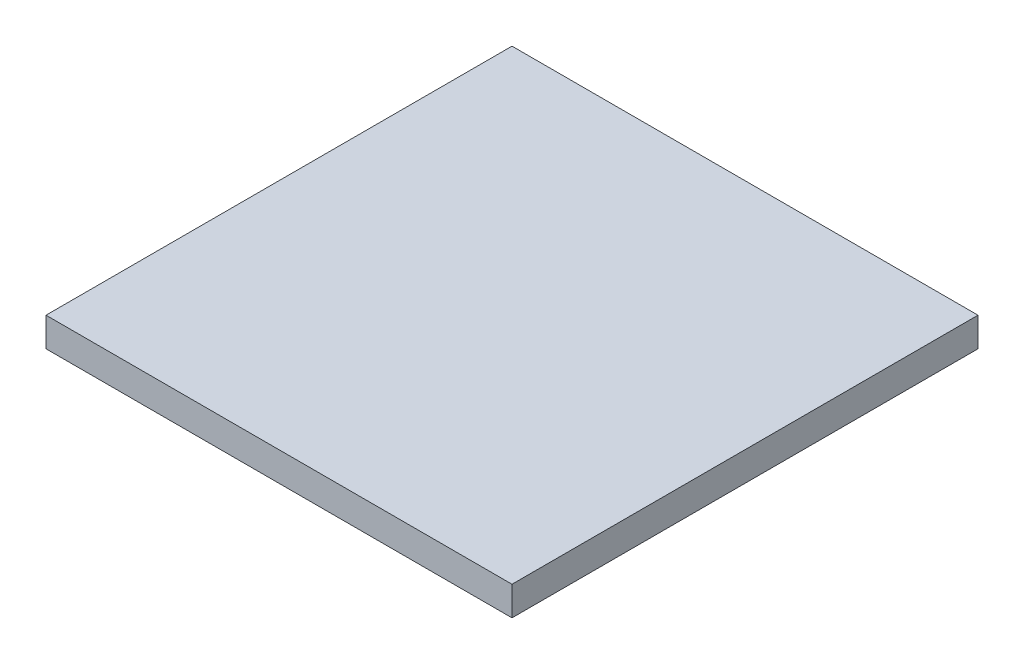
ISO-10303-21;
HEADER;
FILE_DESCRIPTION(('STEP AP214'),'2;1');
FILE_NAME('part.step','',(''),(''),'','','');
FILE_SCHEMA(('AUTOMOTIVE_DESIGN { 1 0 10303 214 1 1 1 1 }'));
ENDSEC;
DATA;
#1=APPLICATION_CONTEXT('core data for automotive mechanical design processes');
#2=APPLICATION_PROTOCOL_DEFINITION('international standard','automotive_design',2000,#1);
#3=PRODUCT_CONTEXT('',#1,'mechanical');
#4=PRODUCT('Part','Part','',(#3));
#5=PRODUCT_RELATED_PRODUCT_CATEGORY('part','',(#4));
#6=PRODUCT_DEFINITION_FORMATION('','',#4);
#7=PRODUCT_DEFINITION_CONTEXT('part definition',#1,'design');
#8=PRODUCT_DEFINITION('design','',#6,#7);
#9=PRODUCT_DEFINITION_SHAPE('','',#8);
#10=(LENGTH_UNIT() NAMED_UNIT(*) SI_UNIT(.MILLI.,.METRE.));
#11=(NAMED_UNIT(*) PLANE_ANGLE_UNIT() SI_UNIT($,.RADIAN.));
#12=(NAMED_UNIT(*) SI_UNIT($,.STERADIAN.) SOLID_ANGLE_UNIT());
#13=UNCERTAINTY_MEASURE_WITH_UNIT(LENGTH_MEASURE(1.E-05),#10,'distance_accuracy_value','');
#14=(GEOMETRIC_REPRESENTATION_CONTEXT(3) GLOBAL_UNCERTAINTY_ASSIGNED_CONTEXT((#13)) GLOBAL_UNIT_ASSIGNED_CONTEXT((#10,
#11,#12)) REPRESENTATION_CONTEXT('',''));
#15=CARTESIAN_POINT('',(0.,0.,0.));
#16=DIRECTION('',(0.,0.,1.));
#17=DIRECTION('',(1.,0.,0.));
#18=AXIS2_PLACEMENT_3D('',#15,#16,#17);
#19=CARTESIAN_POINT('',(0.,1.5875,0.));
#20=DIRECTION('',(1.,0.,0.));
#21=DIRECTION('',(0.,0.,-1.));
#22=AXIS2_PLACEMENT_3D('',#19,#20,#21);
#23=PLANE('',#22);
#24=DIRECTION('',(0.,0.,1.));
#25=VECTOR('',#24,1.);
#26=CARTESIAN_POINT('',(0.,0.,0.));
#27=LINE('',#26,#25);
#28=CARTESIAN_POINT('',(0.,0.,-25.4));
#29=VERTEX_POINT('',#28);
#30=CARTESIAN_POINT('',(0.,0.,0.));
#31=VERTEX_POINT('',#30);
#32=EDGE_CURVE('E95',#29,#31,#27,.T.);
#33=ORIENTED_EDGE('',*,*,#32,.T.);
#34=DIRECTION('',(0.,-1.,0.));
#35=VECTOR('',#34,1.);
#36=CARTESIAN_POINT('',(0.,1.5875,0.));
#37=LINE('',#36,#35);
#38=CARTESIAN_POINT('',(0.,1.5875,0.));
#39=VERTEX_POINT('',#38);
#40=EDGE_CURVE('E11',#39,#31,#37,.T.);
#41=ORIENTED_EDGE('',*,*,#40,.F.);
#42=DIRECTION('',(0.,0.,1.));
#43=VECTOR('',#42,1.);
#44=CARTESIAN_POINT('',(0.,1.5875,0.));
#45=LINE('',#44,#43);
#46=CARTESIAN_POINT('',(0.,1.5875,-25.4));
#47=VERTEX_POINT('',#46);
#48=EDGE_CURVE('E83',#47,#39,#45,.T.);
#49=ORIENTED_EDGE('',*,*,#48,.F.);
#50=DIRECTION('',(0.,-1.,0.));
#51=VECTOR('',#50,1.);
#52=CARTESIAN_POINT('',(0.,1.5875,-25.4));
#53=LINE('',#52,#51);
#54=EDGE_CURVE('E91',#47,#29,#53,.T.);
#55=ORIENTED_EDGE('',*,*,#54,.T.);
#56=EDGE_LOOP('',(#33,#41,#49,#55));
#57=FACE_BOUND('',#56,.T.);
#58=ADVANCED_FACE('F32',(#57),#23,.F.);
#59=CARTESIAN_POINT('',(0.,1.5875,0.));
#60=DIRECTION('',(0.,0.,-1.));
#61=DIRECTION('',(-1.,0.,0.));
#62=AXIS2_PLACEMENT_3D('',#59,#60,#61);
#63=PLANE('',#62);
#64=DIRECTION('',(1.,0.,0.));
#65=VECTOR('',#64,1.);
#66=CARTESIAN_POINT('',(0.,0.,0.));
#67=LINE('',#66,#65);
#68=CARTESIAN_POINT('',(25.4,0.,0.));
#69=VERTEX_POINT('',#68);
#70=EDGE_CURVE('E87',#31,#69,#67,.T.);
#71=ORIENTED_EDGE('',*,*,#70,.T.);
#72=DIRECTION('',(0.,-1.,0.));
#73=VECTOR('',#72,1.);
#74=CARTESIAN_POINT('',(25.4,1.5875,0.));
#75=LINE('',#74,#73);
#76=CARTESIAN_POINT('',(25.4,1.5875,0.));
#77=VERTEX_POINT('',#76);
#78=EDGE_CURVE('E40',#77,#69,#75,.T.);
#79=ORIENTED_EDGE('',*,*,#78,.F.);
#80=DIRECTION('',(1.,0.,0.));
#81=VECTOR('',#80,1.);
#82=CARTESIAN_POINT('',(0.,1.5875,0.));
#83=LINE('',#82,#81);
#84=EDGE_CURVE('E78',#39,#77,#83,.T.);
#85=ORIENTED_EDGE('',*,*,#84,.F.);
#86=ORIENTED_EDGE('',*,*,#40,.T.);
#87=EDGE_LOOP('',(#71,#79,#85,#86));
#88=FACE_BOUND('',#87,.T.);
#89=ADVANCED_FACE('F86',(#88),#63,.F.);
#90=CARTESIAN_POINT('',(25.4,1.5875,0.));
#91=DIRECTION('',(-1.,0.,0.));
#92=DIRECTION('',(0.,0.,1.));
#93=AXIS2_PLACEMENT_3D('',#90,#91,#92);
#94=PLANE('',#93);
#95=DIRECTION('',(0.,0.,-1.));
#96=VECTOR('',#95,1.);
#97=CARTESIAN_POINT('',(25.4,0.,0.));
#98=LINE('',#97,#96);
#99=CARTESIAN_POINT('',(25.4,0.,-25.4));
#100=VERTEX_POINT('',#99);
#101=EDGE_CURVE('E65',#69,#100,#98,.T.);
#102=ORIENTED_EDGE('',*,*,#101,.T.);
#103=DIRECTION('',(0.,-1.,0.));
#104=VECTOR('',#103,1.);
#105=CARTESIAN_POINT('',(25.4,1.5875,-25.4));
#106=LINE('',#105,#104);
#107=CARTESIAN_POINT('',(25.4,1.5875,-25.4));
#108=VERTEX_POINT('',#107);
#109=EDGE_CURVE('E88',#108,#100,#106,.T.);
#110=ORIENTED_EDGE('',*,*,#109,.F.);
#111=DIRECTION('',(0.,0.,-1.));
#112=VECTOR('',#111,1.);
#113=CARTESIAN_POINT('',(25.4,1.5875,0.));
#114=LINE('',#113,#112);
#115=EDGE_CURVE('E81',#77,#108,#114,.T.);
#116=ORIENTED_EDGE('',*,*,#115,.F.);
#117=ORIENTED_EDGE('',*,*,#78,.T.);
#118=EDGE_LOOP('',(#102,#110,#116,#117));
#119=FACE_BOUND('',#118,.T.);
#120=ADVANCED_FACE('F89',(#119),#94,.F.);
#121=CARTESIAN_POINT('',(0.,1.5875,-25.4));
#122=DIRECTION('',(0.,0.,1.));
#123=DIRECTION('',(1.,0.,0.));
#124=AXIS2_PLACEMENT_3D('',#121,#122,#123);
#125=PLANE('',#124);
#126=DIRECTION('',(-1.,0.,0.));
#127=VECTOR('',#126,1.);
#128=CARTESIAN_POINT('',(0.,0.,-25.4));
#129=LINE('',#128,#127);
#130=EDGE_CURVE('E71',#100,#29,#129,.T.);
#131=ORIENTED_EDGE('',*,*,#130,.T.);
#132=ORIENTED_EDGE('',*,*,#54,.F.);
#133=DIRECTION('',(-1.,0.,0.));
#134=VECTOR('',#133,1.);
#135=CARTESIAN_POINT('',(0.,1.5875,-25.4));
#136=LINE('',#135,#134);
#137=EDGE_CURVE('E48',#108,#47,#136,.T.);
#138=ORIENTED_EDGE('',*,*,#137,.F.);
#139=ORIENTED_EDGE('',*,*,#109,.T.);
#140=EDGE_LOOP('',(#131,#132,#138,#139));
#141=FACE_BOUND('',#140,.T.);
#142=ADVANCED_FACE('F102',(#141),#125,.F.);
#143=CARTESIAN_POINT('',(0.,1.5875,0.));
#144=DIRECTION('',(0.,-1.,0.));
#145=DIRECTION('',(0.,0.,-1.));
#146=AXIS2_PLACEMENT_3D('',#143,#144,#145);
#147=PLANE('',#146);
#148=ORIENTED_EDGE('',*,*,#48,.T.);
#149=ORIENTED_EDGE('',*,*,#84,.T.);
#150=ORIENTED_EDGE('',*,*,#115,.T.);
#151=ORIENTED_EDGE('',*,*,#137,.T.);
#152=EDGE_LOOP('',(#148,#149,#150,#151));
#153=FACE_BOUND('',#152,.T.);
#154=ADVANCED_FACE('F79',(#153),#147,.F.);
#155=CARTESIAN_POINT('',(0.,0.,0.));
#156=DIRECTION('',(0.,-1.,0.));
#157=DIRECTION('',(0.,0.,-1.));
#158=AXIS2_PLACEMENT_3D('',#155,#156,#157);
#159=PLANE('',#158);
#160=ORIENTED_EDGE('',*,*,#32,.F.);
#161=ORIENTED_EDGE('',*,*,#130,.F.);
#162=ORIENTED_EDGE('',*,*,#101,.F.);
#163=ORIENTED_EDGE('',*,*,#70,.F.);
#164=EDGE_LOOP('',(#160,#161,#162,#163));
#165=FACE_BOUND('',#164,.T.);
#166=ADVANCED_FACE('F105',(#165),#159,.T.);
#167=CLOSED_SHELL('',(#58,#89,#120,#142,#154,#166));
#168=MANIFOLD_SOLID_BREP('B2',#167);
#169=ADVANCED_BREP_SHAPE_REPRESENTATION('',(#18,#168),#14);
#170=SHAPE_DEFINITION_REPRESENTATION(#9,#169);
ENDSEC;
END-ISO-10303-21;
